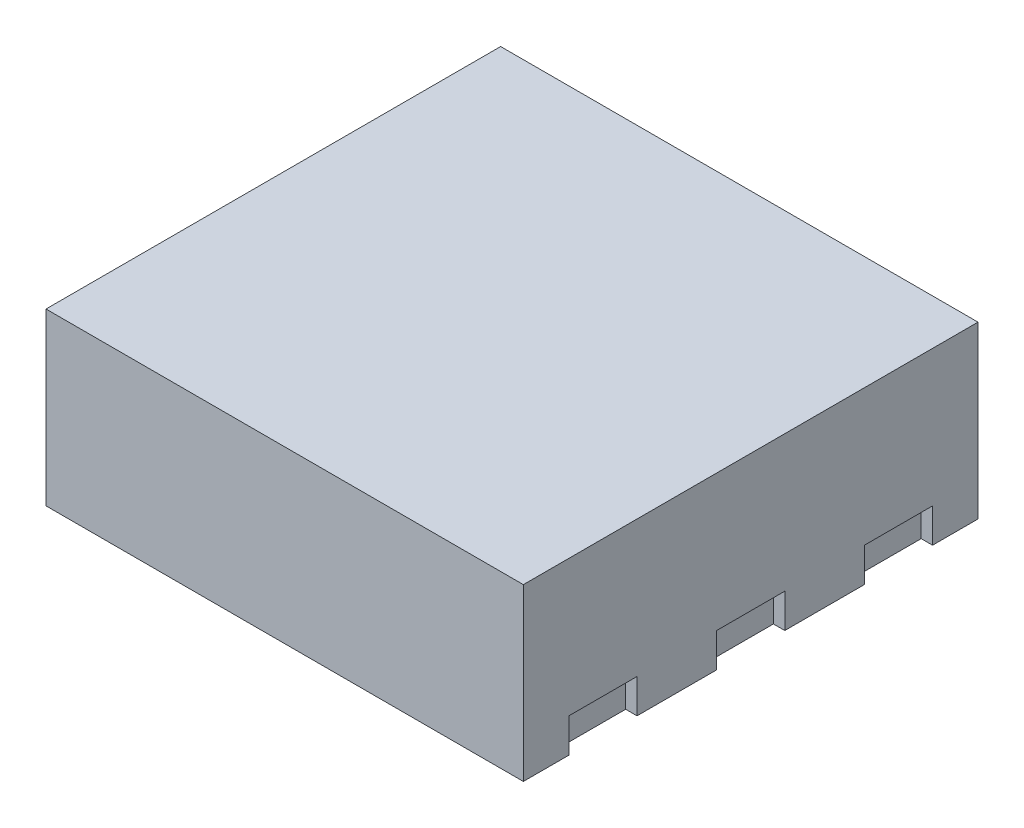
ISO-10303-21;
HEADER;
FILE_DESCRIPTION(('STEP AP214'),'2;1');
FILE_NAME('part.step','',(''),(''),'','','');
FILE_SCHEMA(('AUTOMOTIVE_DESIGN { 1 0 10303 214 1 1 1 1 }'));
ENDSEC;
DATA;
#1=APPLICATION_CONTEXT('core data for automotive mechanical design processes');
#2=APPLICATION_PROTOCOL_DEFINITION('international standard','automotive_design',2000,#1);
#3=PRODUCT_CONTEXT('',#1,'mechanical');
#4=PRODUCT('Part','Part','',(#3));
#5=PRODUCT_RELATED_PRODUCT_CATEGORY('part','',(#4));
#6=PRODUCT_DEFINITION_FORMATION('','',#4);
#7=PRODUCT_DEFINITION_CONTEXT('part definition',#1,'design');
#8=PRODUCT_DEFINITION('design','',#6,#7);
#9=PRODUCT_DEFINITION_SHAPE('','',#8);
#10=(LENGTH_UNIT() NAMED_UNIT(*) SI_UNIT(.MILLI.,.METRE.));
#11=(NAMED_UNIT(*) PLANE_ANGLE_UNIT() SI_UNIT($,.RADIAN.));
#12=(NAMED_UNIT(*) SI_UNIT($,.STERADIAN.) SOLID_ANGLE_UNIT());
#13=UNCERTAINTY_MEASURE_WITH_UNIT(LENGTH_MEASURE(1.E-05),#10,'distance_accuracy_value','');
#14=(GEOMETRIC_REPRESENTATION_CONTEXT(3) GLOBAL_UNCERTAINTY_ASSIGNED_CONTEXT((#13)) GLOBAL_UNIT_ASSIGNED_CONTEXT((#10,
#11,#12)) REPRESENTATION_CONTEXT('',''));
#15=CARTESIAN_POINT('',(0.,0.,0.));
#16=DIRECTION('',(0.,0.,1.));
#17=DIRECTION('',(1.,0.,0.));
#18=AXIS2_PLACEMENT_3D('',#15,#16,#17);
#19=CARTESIAN_POINT('',(-1.05,0.75,1.));
#20=DIRECTION('',(1.,0.,0.));
#21=DIRECTION('',(0.,0.,-1.));
#22=AXIS2_PLACEMENT_3D('',#19,#20,#21);
#23=PLANE('',#22);
#24=DIRECTION('',(0.,-1.,0.));
#25=VECTOR('',#24,1.);
#26=CARTESIAN_POINT('',(-1.05,-0.05,-0.5));
#27=LINE('',#26,#25);
#28=CARTESIAN_POINT('',(-1.05,0.15,-0.5));
#29=VERTEX_POINT('',#28);
#30=CARTESIAN_POINT('',(-1.05,0.,-0.5));
#31=VERTEX_POINT('',#30);
#32=EDGE_CURVE('E276',#29,#31,#27,.T.);
#33=ORIENTED_EDGE('',*,*,#32,.T.);
#34=DIRECTION('',(0.,0.,1.));
#35=VECTOR('',#34,1.);
#36=CARTESIAN_POINT('',(-1.05,0.,1.));
#37=LINE('',#36,#35);
#38=CARTESIAN_POINT('',(-1.05,0.,-0.15));
#39=VERTEX_POINT('',#38);
#40=EDGE_CURVE('E411',#31,#39,#37,.T.);
#41=ORIENTED_EDGE('',*,*,#40,.T.);
#42=DIRECTION('',(0.,1.,0.));
#43=VECTOR('',#42,1.);
#44=CARTESIAN_POINT('',(-1.05,-0.05,-0.15));
#45=LINE('',#44,#43);
#46=CARTESIAN_POINT('',(-1.05,0.15,-0.15));
#47=VERTEX_POINT('',#46);
#48=EDGE_CURVE('E303',#39,#47,#45,.T.);
#49=ORIENTED_EDGE('',*,*,#48,.T.);
#50=DIRECTION('',(0.,0.,1.));
#51=VECTOR('',#50,1.);
#52=CARTESIAN_POINT('',(-1.05,0.15,0.15));
#53=LINE('',#52,#51);
#54=CARTESIAN_POINT('',(-1.05,0.15,0.15));
#55=VERTEX_POINT('',#54);
#56=EDGE_CURVE('E310',#47,#55,#53,.T.);
#57=ORIENTED_EDGE('',*,*,#56,.T.);
#58=DIRECTION('',(0.,-1.,0.));
#59=VECTOR('',#58,1.);
#60=CARTESIAN_POINT('',(-1.05,-0.05,0.15));
#61=LINE('',#60,#59);
#62=CARTESIAN_POINT('',(-1.05,0.,0.15));
#63=VERTEX_POINT('',#62);
#64=EDGE_CURVE('E297',#55,#63,#61,.T.);
#65=ORIENTED_EDGE('',*,*,#64,.T.);
#66=CARTESIAN_POINT('',(-1.05,0.,0.5));
#67=VERTEX_POINT('',#66);
#68=EDGE_CURVE('E855',#63,#67,#37,.T.);
#69=ORIENTED_EDGE('',*,*,#68,.T.);
#70=DIRECTION('',(0.,1.,0.));
#71=VECTOR('',#70,1.);
#72=CARTESIAN_POINT('',(-1.05,-0.05,0.5));
#73=LINE('',#72,#71);
#74=CARTESIAN_POINT('',(-1.05,0.15,0.5));
#75=VERTEX_POINT('',#74);
#76=EDGE_CURVE('E323',#67,#75,#73,.T.);
#77=ORIENTED_EDGE('',*,*,#76,.T.);
#78=DIRECTION('',(0.,0.,1.));
#79=VECTOR('',#78,1.);
#80=CARTESIAN_POINT('',(-1.05,0.15,0.8));
#81=LINE('',#80,#79);
#82=CARTESIAN_POINT('',(-1.05,0.15,0.8));
#83=VERTEX_POINT('',#82);
#84=EDGE_CURVE('E330',#75,#83,#81,.T.);
#85=ORIENTED_EDGE('',*,*,#84,.T.);
#86=DIRECTION('',(0.,-1.,0.));
#87=VECTOR('',#86,1.);
#88=CARTESIAN_POINT('',(-1.05,-0.05,0.8));
#89=LINE('',#88,#87);
#90=CARTESIAN_POINT('',(-1.05,0.,0.8));
#91=VERTEX_POINT('',#90);
#92=EDGE_CURVE('E317',#83,#91,#89,.T.);
#93=ORIENTED_EDGE('',*,*,#92,.T.);
#94=CARTESIAN_POINT('',(-1.05,0.,1.));
#95=VERTEX_POINT('',#94);
#96=EDGE_CURVE('E393',#91,#95,#37,.T.);
#97=ORIENTED_EDGE('',*,*,#96,.T.);
#98=DIRECTION('',(0.,-1.,0.));
#99=VECTOR('',#98,1.);
#100=CARTESIAN_POINT('',(-1.05,0.75,1.));
#101=LINE('',#100,#99);
#102=CARTESIAN_POINT('',(-1.05,0.75,1.));
#103=VERTEX_POINT('',#102);
#104=EDGE_CURVE('E427',#103,#95,#101,.T.);
#105=ORIENTED_EDGE('',*,*,#104,.F.);
#106=DIRECTION('',(0.,0.,1.));
#107=VECTOR('',#106,1.);
#108=CARTESIAN_POINT('',(-1.05,0.75,1.));
#109=LINE('',#108,#107);
#110=CARTESIAN_POINT('',(-1.05,0.75,-1.));
#111=VERTEX_POINT('',#110);
#112=EDGE_CURVE('E396',#111,#103,#109,.T.);
#113=ORIENTED_EDGE('',*,*,#112,.F.);
#114=DIRECTION('',(0.,-1.,0.));
#115=VECTOR('',#114,1.);
#116=CARTESIAN_POINT('',(-1.05,0.75,-1.));
#117=LINE('',#116,#115);
#118=CARTESIAN_POINT('',(-1.05,0.,-1.));
#119=VERTEX_POINT('',#118);
#120=EDGE_CURVE('E406',#111,#119,#117,.T.);
#121=ORIENTED_EDGE('',*,*,#120,.T.);
#122=CARTESIAN_POINT('',(-1.05,0.,-0.8));
#123=VERTEX_POINT('',#122);
#124=EDGE_CURVE('E407',#119,#123,#37,.T.);
#125=ORIENTED_EDGE('',*,*,#124,.T.);
#126=DIRECTION('',(0.,1.,0.));
#127=VECTOR('',#126,1.);
#128=CARTESIAN_POINT('',(-1.05,-0.05,-0.8));
#129=LINE('',#128,#127);
#130=CARTESIAN_POINT('',(-1.05,0.15,-0.8));
#131=VERTEX_POINT('',#130);
#132=EDGE_CURVE('E284',#123,#131,#129,.T.);
#133=ORIENTED_EDGE('',*,*,#132,.T.);
#134=DIRECTION('',(0.,0.,1.));
#135=VECTOR('',#134,1.);
#136=CARTESIAN_POINT('',(-1.05,0.15,-0.5));
#137=LINE('',#136,#135);
#138=EDGE_CURVE('E290',#131,#29,#137,.T.);
#139=ORIENTED_EDGE('',*,*,#138,.T.);
#140=EDGE_LOOP('',(#33,#41,#49,#57,#65,#69,#77,#85,#93,#97,#105,#113,#121,#125,#133,#139));
#141=FACE_BOUND('',#140,.T.);
#142=ADVANCED_FACE('F33',(#141),#23,.F.);
#143=CARTESIAN_POINT('',(-1.05,0.,-1.));
#144=DIRECTION('',(0.,-1.,0.));
#145=DIRECTION('',(0.,0.,-1.));
#146=AXIS2_PLACEMENT_3D('',#143,#144,#145);
#147=PLANE('',#146);
#148=DIRECTION('',(0.,0.,-1.));
#149=VECTOR('',#148,1.);
#150=CARTESIAN_POINT('',(-0.325,0.,-0.675));
#151=LINE('',#150,#149);
#152=CARTESIAN_POINT('',(-0.325,0.,0.675));
#153=VERTEX_POINT('',#152);
#154=CARTESIAN_POINT('',(-0.325,0.,-0.675));
#155=VERTEX_POINT('',#154);
#156=EDGE_CURVE('E47',#153,#155,#151,.T.);
#157=ORIENTED_EDGE('',*,*,#156,.F.);
#158=DIRECTION('',(-1.,0.,0.));
#159=VECTOR('',#158,1.);
#160=CARTESIAN_POINT('',(-0.325,0.,0.675));
#161=LINE('',#160,#159);
#162=CARTESIAN_POINT('',(0.325,0.,0.675));
#163=VERTEX_POINT('',#162);
#164=EDGE_CURVE('E261',#163,#153,#161,.T.);
#165=ORIENTED_EDGE('',*,*,#164,.F.);
#166=DIRECTION('',(0.,0.,1.));
#167=VECTOR('',#166,1.);
#168=CARTESIAN_POINT('',(0.325,0.,-0.675));
#169=LINE('',#168,#167);
#170=CARTESIAN_POINT('',(0.325,0.,-0.675));
#171=VERTEX_POINT('',#170);
#172=EDGE_CURVE('E264',#171,#163,#169,.T.);
#173=ORIENTED_EDGE('',*,*,#172,.F.);
#174=DIRECTION('',(1.,0.,0.));
#175=VECTOR('',#174,1.);
#176=CARTESIAN_POINT('',(-0.325,0.,-0.675));
#177=LINE('',#176,#175);
#178=EDGE_CURVE('E270',#155,#171,#177,.T.);
#179=ORIENTED_EDGE('',*,*,#178,.F.);
#180=EDGE_LOOP('',(#157,#165,#173,#179));
#181=FACE_BOUND('',#180,.T.);
#182=ORIENTED_EDGE('',*,*,#40,.F.);
#183=DIRECTION('',(1.,0.,0.));
#184=VECTOR('',#183,1.);
#185=CARTESIAN_POINT('',(-1.05,0.,-0.5));
#186=LINE('',#185,#184);
#187=CARTESIAN_POINT('',(-1.,0.,-0.5));
#188=VERTEX_POINT('',#187);
#189=EDGE_CURVE('E11',#31,#188,#186,.T.);
#190=ORIENTED_EDGE('',*,*,#189,.T.);
#191=DIRECTION('',(0.,0.,1.));
#192=VECTOR('',#191,1.);
#193=CARTESIAN_POINT('',(-1.,0.,-1.));
#194=LINE('',#193,#192);
#195=CARTESIAN_POINT('',(-1.,0.,-0.8));
#196=VERTEX_POINT('',#195);
#197=EDGE_CURVE('E467',#196,#188,#194,.T.);
#198=ORIENTED_EDGE('',*,*,#197,.F.);
#199=DIRECTION('',(-1.,0.,0.));
#200=VECTOR('',#199,1.);
#201=CARTESIAN_POINT('',(-1.05,0.,-0.8));
#202=LINE('',#201,#200);
#203=EDGE_CURVE('E40',#196,#123,#202,.T.);
#204=ORIENTED_EDGE('',*,*,#203,.T.);
#205=ORIENTED_EDGE('',*,*,#124,.F.);
#206=DIRECTION('',(-1.,0.,0.));
#207=VECTOR('',#206,1.);
#208=CARTESIAN_POINT('',(-1.05,0.,-1.));
#209=LINE('',#208,#207);
#210=CARTESIAN_POINT('',(1.05,0.,-1.));
#211=VERTEX_POINT('',#210);
#212=EDGE_CURVE('E400',#211,#119,#209,.T.);
#213=ORIENTED_EDGE('',*,*,#212,.F.);
#214=DIRECTION('',(0.,0.,-1.));
#215=VECTOR('',#214,1.);
#216=CARTESIAN_POINT('',(1.05,0.,1.));
#217=LINE('',#216,#215);
#218=CARTESIAN_POINT('',(1.05,0.,-0.8));
#219=VERTEX_POINT('',#218);
#220=EDGE_CURVE('E413',#219,#211,#217,.T.);
#221=ORIENTED_EDGE('',*,*,#220,.F.);
#222=DIRECTION('',(1.,0.,0.));
#223=VECTOR('',#222,1.);
#224=CARTESIAN_POINT('',(-1.05,0.,-0.8));
#225=LINE('',#224,#223);
#226=CARTESIAN_POINT('',(1.,0.,-0.8));
#227=VERTEX_POINT('',#226);
#228=EDGE_CURVE('E446',#227,#219,#225,.T.);
#229=ORIENTED_EDGE('',*,*,#228,.F.);
#230=DIRECTION('',(0.,0.,-1.));
#231=VECTOR('',#230,1.);
#232=CARTESIAN_POINT('',(1.,0.,-1.));
#233=LINE('',#232,#231);
#234=CARTESIAN_POINT('',(1.,0.,-0.5));
#235=VERTEX_POINT('',#234);
#236=EDGE_CURVE('E444',#235,#227,#233,.T.);
#237=ORIENTED_EDGE('',*,*,#236,.F.);
#238=DIRECTION('',(-1.,0.,0.));
#239=VECTOR('',#238,1.);
#240=CARTESIAN_POINT('',(-1.05,0.,-0.5));
#241=LINE('',#240,#239);
#242=CARTESIAN_POINT('',(1.05,0.,-0.5));
#243=VERTEX_POINT('',#242);
#244=EDGE_CURVE('E448',#243,#235,#241,.T.);
#245=ORIENTED_EDGE('',*,*,#244,.F.);
#246=CARTESIAN_POINT('',(1.05,0.,-0.15));
#247=VERTEX_POINT('',#246);
#248=EDGE_CURVE('E489',#247,#243,#217,.T.);
#249=ORIENTED_EDGE('',*,*,#248,.F.);
#250=DIRECTION('',(1.,0.,0.));
#251=VECTOR('',#250,1.);
#252=CARTESIAN_POINT('',(-1.05,0.,-0.15));
#253=LINE('',#252,#251);
#254=CARTESIAN_POINT('',(1.,0.,-0.15));
#255=VERTEX_POINT('',#254);
#256=EDGE_CURVE('E439',#255,#247,#253,.T.);
#257=ORIENTED_EDGE('',*,*,#256,.F.);
#258=DIRECTION('',(0.,0.,-1.));
#259=VECTOR('',#258,1.);
#260=CARTESIAN_POINT('',(1.,0.,-1.));
#261=LINE('',#260,#259);
#262=CARTESIAN_POINT('',(1.,0.,0.15));
#263=VERTEX_POINT('',#262);
#264=EDGE_CURVE('E437',#263,#255,#261,.T.);
#265=ORIENTED_EDGE('',*,*,#264,.F.);
#266=DIRECTION('',(-1.,0.,0.));
#267=VECTOR('',#266,1.);
#268=CARTESIAN_POINT('',(-1.05,0.,0.15));
#269=LINE('',#268,#267);
#270=CARTESIAN_POINT('',(1.05,0.,0.15));
#271=VERTEX_POINT('',#270);
#272=EDGE_CURVE('E441',#271,#263,#269,.T.);
#273=ORIENTED_EDGE('',*,*,#272,.F.);
#274=CARTESIAN_POINT('',(1.05,0.,0.5));
#275=VERTEX_POINT('',#274);
#276=EDGE_CURVE('E417',#275,#271,#217,.T.);
#277=ORIENTED_EDGE('',*,*,#276,.F.);
#278=DIRECTION('',(1.,0.,0.));
#279=VECTOR('',#278,1.);
#280=CARTESIAN_POINT('',(-1.05,0.,0.5));
#281=LINE('',#280,#279);
#282=CARTESIAN_POINT('',(1.,0.,0.5));
#283=VERTEX_POINT('',#282);
#284=EDGE_CURVE('E432',#283,#275,#281,.T.);
#285=ORIENTED_EDGE('',*,*,#284,.F.);
#286=DIRECTION('',(0.,0.,-1.));
#287=VECTOR('',#286,1.);
#288=CARTESIAN_POINT('',(1.,0.,-1.));
#289=LINE('',#288,#287);
#290=CARTESIAN_POINT('',(1.,0.,0.8));
#291=VERTEX_POINT('',#290);
#292=EDGE_CURVE('E430',#291,#283,#289,.T.);
#293=ORIENTED_EDGE('',*,*,#292,.F.);
#294=DIRECTION('',(-1.,0.,0.));
#295=VECTOR('',#294,1.);
#296=CARTESIAN_POINT('',(-1.05,0.,0.8));
#297=LINE('',#296,#295);
#298=CARTESIAN_POINT('',(1.05,0.,0.8));
#299=VERTEX_POINT('',#298);
#300=EDGE_CURVE('E434',#299,#291,#297,.T.);
#301=ORIENTED_EDGE('',*,*,#300,.F.);
#302=CARTESIAN_POINT('',(1.05,0.,1.));
#303=VERTEX_POINT('',#302);
#304=EDGE_CURVE('E414',#303,#299,#217,.T.);
#305=ORIENTED_EDGE('',*,*,#304,.F.);
#306=DIRECTION('',(1.,0.,0.));
#307=VECTOR('',#306,1.);
#308=CARTESIAN_POINT('',(-1.05,0.,1.));
#309=LINE('',#308,#307);
#310=EDGE_CURVE('E410',#95,#303,#309,.T.);
#311=ORIENTED_EDGE('',*,*,#310,.F.);
#312=ORIENTED_EDGE('',*,*,#96,.F.);
#313=DIRECTION('',(1.,0.,0.));
#314=VECTOR('',#313,1.);
#315=CARTESIAN_POINT('',(-1.05,0.,0.8));
#316=LINE('',#315,#314);
#317=CARTESIAN_POINT('',(-1.,0.,0.8));
#318=VERTEX_POINT('',#317);
#319=EDGE_CURVE('E456',#91,#318,#316,.T.);
#320=ORIENTED_EDGE('',*,*,#319,.T.);
#321=DIRECTION('',(0.,0.,1.));
#322=VECTOR('',#321,1.);
#323=CARTESIAN_POINT('',(-1.,0.,-1.));
#324=LINE('',#323,#322);
#325=CARTESIAN_POINT('',(-1.,0.,0.5));
#326=VERTEX_POINT('',#325);
#327=EDGE_CURVE('E451',#326,#318,#324,.T.);
#328=ORIENTED_EDGE('',*,*,#327,.F.);
#329=DIRECTION('',(-1.,0.,0.));
#330=VECTOR('',#329,1.);
#331=CARTESIAN_POINT('',(-1.05,0.,0.5));
#332=LINE('',#331,#330);
#333=EDGE_CURVE('E453',#326,#67,#332,.T.);
#334=ORIENTED_EDGE('',*,*,#333,.T.);
#335=ORIENTED_EDGE('',*,*,#68,.F.);
#336=DIRECTION('',(1.,0.,0.));
#337=VECTOR('',#336,1.);
#338=CARTESIAN_POINT('',(-1.05,0.,0.15));
#339=LINE('',#338,#337);
#340=CARTESIAN_POINT('',(-1.,0.,0.15));
#341=VERTEX_POINT('',#340);
#342=EDGE_CURVE('E464',#63,#341,#339,.T.);
#343=ORIENTED_EDGE('',*,*,#342,.T.);
#344=DIRECTION('',(0.,0.,1.));
#345=VECTOR('',#344,1.);
#346=CARTESIAN_POINT('',(-1.,0.,-1.));
#347=LINE('',#346,#345);
#348=CARTESIAN_POINT('',(-1.,0.,-0.15));
#349=VERTEX_POINT('',#348);
#350=EDGE_CURVE('E459',#349,#341,#347,.T.);
#351=ORIENTED_EDGE('',*,*,#350,.F.);
#352=DIRECTION('',(-1.,0.,0.));
#353=VECTOR('',#352,1.);
#354=CARTESIAN_POINT('',(-1.05,0.,-0.15));
#355=LINE('',#354,#353);
#356=EDGE_CURVE('E461',#349,#39,#355,.T.);
#357=ORIENTED_EDGE('',*,*,#356,.T.);
#358=EDGE_LOOP('',(#182,#190,#198,#204,#205,#213,#221,#229,#237,#245,#249,#257,#265,#273,#277,
#285,#293,#301,#305,#311,#312,#320,#328,#334,#335,#343,#351,#357));
#359=FACE_BOUND('',#358,.T.);
#360=ADVANCED_FACE('F473',(#181,#359),#147,.T.);
#361=CARTESIAN_POINT('',(-1.05,0.75,1.));
#362=DIRECTION('',(0.,0.,-1.));
#363=DIRECTION('',(-1.,0.,0.));
#364=AXIS2_PLACEMENT_3D('',#361,#362,#363);
#365=PLANE('',#364);
#366=ORIENTED_EDGE('',*,*,#310,.T.);
#367=DIRECTION('',(0.,-1.,0.));
#368=VECTOR('',#367,1.);
#369=CARTESIAN_POINT('',(1.05,0.75,1.));
#370=LINE('',#369,#368);
#371=CARTESIAN_POINT('',(1.05,0.75,1.));
#372=VERTEX_POINT('',#371);
#373=EDGE_CURVE('E424',#372,#303,#370,.T.);
#374=ORIENTED_EDGE('',*,*,#373,.F.);
#375=DIRECTION('',(1.,0.,0.));
#376=VECTOR('',#375,1.);
#377=CARTESIAN_POINT('',(-1.05,0.75,1.));
#378=LINE('',#377,#376);
#379=EDGE_CURVE('E399',#103,#372,#378,.T.);
#380=ORIENTED_EDGE('',*,*,#379,.F.);
#381=ORIENTED_EDGE('',*,*,#104,.T.);
#382=EDGE_LOOP('',(#366,#374,#380,#381));
#383=FACE_BOUND('',#382,.T.);
#384=ADVANCED_FACE('F545',(#383),#365,.F.);
#385=CARTESIAN_POINT('',(1.05,0.75,1.));
#386=DIRECTION('',(-1.,0.,0.));
#387=DIRECTION('',(0.,0.,1.));
#388=AXIS2_PLACEMENT_3D('',#385,#386,#387);
#389=PLANE('',#388);
#390=ORIENTED_EDGE('',*,*,#248,.T.);
#391=DIRECTION('',(0.,-1.,0.));
#392=VECTOR('',#391,1.);
#393=CARTESIAN_POINT('',(1.05,-0.05,-0.5));
#394=LINE('',#393,#392);
#395=CARTESIAN_POINT('',(1.05,0.15,-0.5));
#396=VERTEX_POINT('',#395);
#397=EDGE_CURVE('E337',#396,#243,#394,.T.);
#398=ORIENTED_EDGE('',*,*,#397,.F.);
#399=DIRECTION('',(0.,0.,1.));
#400=VECTOR('',#399,1.);
#401=CARTESIAN_POINT('',(1.05,0.15,-0.5));
#402=LINE('',#401,#400);
#403=CARTESIAN_POINT('',(1.05,0.15,-0.8));
#404=VERTEX_POINT('',#403);
#405=EDGE_CURVE('E342',#404,#396,#402,.T.);
#406=ORIENTED_EDGE('',*,*,#405,.F.);
#407=DIRECTION('',(0.,1.,0.));
#408=VECTOR('',#407,1.);
#409=CARTESIAN_POINT('',(1.05,-0.05,-0.8));
#410=LINE('',#409,#408);
#411=EDGE_CURVE('E349',#219,#404,#410,.T.);
#412=ORIENTED_EDGE('',*,*,#411,.F.);
#413=ORIENTED_EDGE('',*,*,#220,.T.);
#414=DIRECTION('',(0.,-1.,0.));
#415=VECTOR('',#414,1.);
#416=CARTESIAN_POINT('',(1.05,0.75,-1.));
#417=LINE('',#416,#415);
#418=CARTESIAN_POINT('',(1.05,0.75,-1.));
#419=VERTEX_POINT('',#418);
#420=EDGE_CURVE('E421',#419,#211,#417,.T.);
#421=ORIENTED_EDGE('',*,*,#420,.F.);
#422=DIRECTION('',(0.,0.,-1.));
#423=VECTOR('',#422,1.);
#424=CARTESIAN_POINT('',(1.05,0.75,1.));
#425=LINE('',#424,#423);
#426=EDGE_CURVE('E402',#372,#419,#425,.T.);
#427=ORIENTED_EDGE('',*,*,#426,.F.);
#428=ORIENTED_EDGE('',*,*,#373,.T.);
#429=ORIENTED_EDGE('',*,*,#304,.T.);
#430=DIRECTION('',(0.,-1.,0.));
#431=VECTOR('',#430,1.);
#432=CARTESIAN_POINT('',(1.05,-0.05,0.8));
#433=LINE('',#432,#431);
#434=CARTESIAN_POINT('',(1.05,0.15,0.8));
#435=VERTEX_POINT('',#434);
#436=EDGE_CURVE('E374',#435,#299,#433,.T.);
#437=ORIENTED_EDGE('',*,*,#436,.F.);
#438=DIRECTION('',(0.,0.,1.));
#439=VECTOR('',#438,1.);
#440=CARTESIAN_POINT('',(1.05,0.15,0.8));
#441=LINE('',#440,#439);
#442=CARTESIAN_POINT('',(1.05,0.15,0.5));
#443=VERTEX_POINT('',#442);
#444=EDGE_CURVE('E380',#443,#435,#441,.T.);
#445=ORIENTED_EDGE('',*,*,#444,.F.);
#446=DIRECTION('',(0.,1.,0.));
#447=VECTOR('',#446,1.);
#448=CARTESIAN_POINT('',(1.05,-0.05,0.5));
#449=LINE('',#448,#447);
#450=EDGE_CURVE('E387',#275,#443,#449,.T.);
#451=ORIENTED_EDGE('',*,*,#450,.F.);
#452=ORIENTED_EDGE('',*,*,#276,.T.);
#453=DIRECTION('',(0.,-1.,0.));
#454=VECTOR('',#453,1.);
#455=CARTESIAN_POINT('',(1.05,-0.05,0.15));
#456=LINE('',#455,#454);
#457=CARTESIAN_POINT('',(1.05,0.15,0.15));
#458=VERTEX_POINT('',#457);
#459=EDGE_CURVE('E355',#458,#271,#456,.T.);
#460=ORIENTED_EDGE('',*,*,#459,.F.);
#461=DIRECTION('',(0.,0.,1.));
#462=VECTOR('',#461,1.);
#463=CARTESIAN_POINT('',(1.05,0.15,0.15));
#464=LINE('',#463,#462);
#465=CARTESIAN_POINT('',(1.05,0.15,-0.15));
#466=VERTEX_POINT('',#465);
#467=EDGE_CURVE('E361',#466,#458,#464,.T.);
#468=ORIENTED_EDGE('',*,*,#467,.F.);
#469=DIRECTION('',(0.,1.,0.));
#470=VECTOR('',#469,1.);
#471=CARTESIAN_POINT('',(1.05,-0.05,-0.15));
#472=LINE('',#471,#470);
#473=EDGE_CURVE('E368',#247,#466,#472,.T.);
#474=ORIENTED_EDGE('',*,*,#473,.F.);
#475=EDGE_LOOP('',(#390,#398,#406,#412,#413,#421,#427,#428,#429,#437,#445,#451,#452,#460,#468,#474));
#476=FACE_BOUND('',#475,.T.);
#477=ADVANCED_FACE('F498',(#476),#389,.F.);
#478=CARTESIAN_POINT('',(-1.05,0.75,-1.));
#479=DIRECTION('',(0.,0.,1.));
#480=DIRECTION('',(1.,0.,0.));
#481=AXIS2_PLACEMENT_3D('',#478,#479,#480);
#482=PLANE('',#481);
#483=ORIENTED_EDGE('',*,*,#212,.T.);
#484=ORIENTED_EDGE('',*,*,#120,.F.);
#485=DIRECTION('',(-1.,0.,0.));
#486=VECTOR('',#485,1.);
#487=CARTESIAN_POINT('',(-1.05,0.75,-1.));
#488=LINE('',#487,#486);
#489=EDGE_CURVE('E404',#419,#111,#488,.T.);
#490=ORIENTED_EDGE('',*,*,#489,.F.);
#491=ORIENTED_EDGE('',*,*,#420,.T.);
#492=EDGE_LOOP('',(#483,#484,#490,#491));
#493=FACE_BOUND('',#492,.T.);
#494=ADVANCED_FACE('F482',(#493),#482,.F.);
#495=CARTESIAN_POINT('',(-1.05,0.75,-1.));
#496=DIRECTION('',(0.,-1.,0.));
#497=DIRECTION('',(0.,0.,-1.));
#498=AXIS2_PLACEMENT_3D('',#495,#496,#497);
#499=PLANE('',#498);
#500=ORIENTED_EDGE('',*,*,#112,.T.);
#501=ORIENTED_EDGE('',*,*,#379,.T.);
#502=ORIENTED_EDGE('',*,*,#426,.T.);
#503=ORIENTED_EDGE('',*,*,#489,.T.);
#504=EDGE_LOOP('',(#500,#501,#502,#503));
#505=FACE_BOUND('',#504,.T.);
#506=ADVANCED_FACE('F555',(#505),#499,.F.);
#507=CARTESIAN_POINT('',(1.,-0.05,0.8));
#508=DIRECTION('',(0.,0.,1.));
#509=DIRECTION('',(1.,0.,0.));
#510=AXIS2_PLACEMENT_3D('',#507,#508,#509);
#511=PLANE('',#510);
#512=ORIENTED_EDGE('',*,*,#300,.T.);
#513=DIRECTION('',(0.,-1.,0.));
#514=VECTOR('',#513,1.);
#515=CARTESIAN_POINT('',(1.,-0.05,0.8));
#516=LINE('',#515,#514);
#517=CARTESIAN_POINT('',(1.,0.15,0.8));
#518=VERTEX_POINT('',#517);
#519=EDGE_CURVE('E377',#518,#291,#516,.T.);
#520=ORIENTED_EDGE('',*,*,#519,.F.);
#521=DIRECTION('',(1.,0.,0.));
#522=VECTOR('',#521,1.);
#523=CARTESIAN_POINT('',(1.,0.15,0.8));
#524=LINE('',#523,#522);
#525=EDGE_CURVE('E391',#518,#435,#524,.T.);
#526=ORIENTED_EDGE('',*,*,#525,.T.);
#527=ORIENTED_EDGE('',*,*,#436,.T.);
#528=EDGE_LOOP('',(#512,#520,#526,#527));
#529=FACE_BOUND('',#528,.T.);
#530=ADVANCED_FACE('F575',(#529),#511,.F.);
#531=CARTESIAN_POINT('',(1.,0.15,0.8));
#532=DIRECTION('',(0.,1.,0.));
#533=DIRECTION('',(0.,0.,1.));
#534=AXIS2_PLACEMENT_3D('',#531,#532,#533);
#535=PLANE('',#534);
#536=ORIENTED_EDGE('',*,*,#444,.T.);
#537=ORIENTED_EDGE('',*,*,#525,.F.);
#538=DIRECTION('',(0.,0.,1.));
#539=VECTOR('',#538,1.);
#540=CARTESIAN_POINT('',(1.,0.15,0.8));
#541=LINE('',#540,#539);
#542=CARTESIAN_POINT('',(1.,0.15,0.5));
#543=VERTEX_POINT('',#542);
#544=EDGE_CURVE('E382',#543,#518,#541,.T.);
#545=ORIENTED_EDGE('',*,*,#544,.F.);
#546=DIRECTION('',(1.,0.,0.));
#547=VECTOR('',#546,1.);
#548=CARTESIAN_POINT('',(1.,0.15,0.5));
#549=LINE('',#548,#547);
#550=EDGE_CURVE('E385',#543,#443,#549,.T.);
#551=ORIENTED_EDGE('',*,*,#550,.T.);
#552=EDGE_LOOP('',(#536,#537,#545,#551));
#553=FACE_BOUND('',#552,.T.);
#554=ADVANCED_FACE('F582',(#553),#535,.F.);
#555=CARTESIAN_POINT('',(1.,-0.05,0.5));
#556=DIRECTION('',(0.,0.,-1.));
#557=DIRECTION('',(-1.,0.,0.));
#558=AXIS2_PLACEMENT_3D('',#555,#556,#557);
#559=PLANE('',#558);
#560=ORIENTED_EDGE('',*,*,#284,.T.);
#561=ORIENTED_EDGE('',*,*,#450,.T.);
#562=ORIENTED_EDGE('',*,*,#550,.F.);
#563=DIRECTION('',(0.,1.,0.));
#564=VECTOR('',#563,1.);
#565=CARTESIAN_POINT('',(1.,-0.05,0.5));
#566=LINE('',#565,#564);
#567=EDGE_CURVE('E379',#283,#543,#566,.T.);
#568=ORIENTED_EDGE('',*,*,#567,.F.);
#569=EDGE_LOOP('',(#560,#561,#562,#568));
#570=FACE_BOUND('',#569,.T.);
#571=ADVANCED_FACE('F590',(#570),#559,.F.);
#572=CARTESIAN_POINT('',(1.,0.15,0.8));
#573=DIRECTION('',(-1.,0.,0.));
#574=DIRECTION('',(0.,0.,1.));
#575=AXIS2_PLACEMENT_3D('',#572,#573,#574);
#576=PLANE('',#575);
#577=ORIENTED_EDGE('',*,*,#292,.T.);
#578=ORIENTED_EDGE('',*,*,#567,.T.);
#579=ORIENTED_EDGE('',*,*,#544,.T.);
#580=ORIENTED_EDGE('',*,*,#519,.T.);
#581=EDGE_LOOP('',(#577,#578,#579,#580));
#582=FACE_BOUND('',#581,.T.);
#583=ADVANCED_FACE('F599',(#582),#576,.F.);
#584=CARTESIAN_POINT('',(1.,-0.05,0.15));
#585=DIRECTION('',(0.,0.,1.));
#586=DIRECTION('',(1.,0.,0.));
#587=AXIS2_PLACEMENT_3D('',#584,#585,#586);
#588=PLANE('',#587);
#589=ORIENTED_EDGE('',*,*,#272,.T.);
#590=DIRECTION('',(0.,-1.,0.));
#591=VECTOR('',#590,1.);
#592=CARTESIAN_POINT('',(1.,-0.05,0.15));
#593=LINE('',#592,#591);
#594=CARTESIAN_POINT('',(1.,0.15,0.15));
#595=VERTEX_POINT('',#594);
#596=EDGE_CURVE('E358',#595,#263,#593,.T.);
#597=ORIENTED_EDGE('',*,*,#596,.F.);
#598=DIRECTION('',(1.,0.,0.));
#599=VECTOR('',#598,1.);
#600=CARTESIAN_POINT('',(1.,0.15,0.15));
#601=LINE('',#600,#599);
#602=EDGE_CURVE('E372',#595,#458,#601,.T.);
#603=ORIENTED_EDGE('',*,*,#602,.T.);
#604=ORIENTED_EDGE('',*,*,#459,.T.);
#605=EDGE_LOOP('',(#589,#597,#603,#604));
#606=FACE_BOUND('',#605,.T.);
#607=ADVANCED_FACE('F508',(#606),#588,.F.);
#608=CARTESIAN_POINT('',(1.,0.15,0.15));
#609=DIRECTION('',(0.,1.,0.));
#610=DIRECTION('',(0.,0.,1.));
#611=AXIS2_PLACEMENT_3D('',#608,#609,#610);
#612=PLANE('',#611);
#613=ORIENTED_EDGE('',*,*,#467,.T.);
#614=ORIENTED_EDGE('',*,*,#602,.F.);
#615=DIRECTION('',(0.,0.,1.));
#616=VECTOR('',#615,1.);
#617=CARTESIAN_POINT('',(1.,0.15,0.15));
#618=LINE('',#617,#616);
#619=CARTESIAN_POINT('',(1.,0.15,-0.15));
#620=VERTEX_POINT('',#619);
#621=EDGE_CURVE('E363',#620,#595,#618,.T.);
#622=ORIENTED_EDGE('',*,*,#621,.F.);
#623=DIRECTION('',(1.,0.,0.));
#624=VECTOR('',#623,1.);
#625=CARTESIAN_POINT('',(1.,0.15,-0.15));
#626=LINE('',#625,#624);
#627=EDGE_CURVE('E366',#620,#466,#626,.T.);
#628=ORIENTED_EDGE('',*,*,#627,.T.);
#629=EDGE_LOOP('',(#613,#614,#622,#628));
#630=FACE_BOUND('',#629,.T.);
#631=ADVANCED_FACE('F511',(#630),#612,.F.);
#632=CARTESIAN_POINT('',(1.,-0.05,-0.15));
#633=DIRECTION('',(0.,0.,-1.));
#634=DIRECTION('',(0.,1.,0.));
#635=AXIS2_PLACEMENT_3D('',#632,#633,#634);
#636=PLANE('',#635);
#637=ORIENTED_EDGE('',*,*,#256,.T.);
#638=ORIENTED_EDGE('',*,*,#473,.T.);
#639=ORIENTED_EDGE('',*,*,#627,.F.);
#640=DIRECTION('',(0.,1.,0.));
#641=VECTOR('',#640,1.);
#642=CARTESIAN_POINT('',(1.,-0.05,-0.15));
#643=LINE('',#642,#641);
#644=EDGE_CURVE('E360',#255,#620,#643,.T.);
#645=ORIENTED_EDGE('',*,*,#644,.F.);
#646=EDGE_LOOP('',(#637,#638,#639,#645));
#647=FACE_BOUND('',#646,.T.);
#648=ADVANCED_FACE('F621',(#647),#636,.F.);
#649=CARTESIAN_POINT('',(1.,0.15,0.15));
#650=DIRECTION('',(-1.,0.,0.));
#651=DIRECTION('',(0.,0.,1.));
#652=AXIS2_PLACEMENT_3D('',#649,#650,#651);
#653=PLANE('',#652);
#654=ORIENTED_EDGE('',*,*,#264,.T.);
#655=ORIENTED_EDGE('',*,*,#644,.T.);
#656=ORIENTED_EDGE('',*,*,#621,.T.);
#657=ORIENTED_EDGE('',*,*,#596,.T.);
#658=EDGE_LOOP('',(#654,#655,#656,#657));
#659=FACE_BOUND('',#658,.T.);
#660=ADVANCED_FACE('F628',(#659),#653,.F.);
#661=CARTESIAN_POINT('',(1.,-0.05,-0.5));
#662=DIRECTION('',(0.,0.,1.));
#663=DIRECTION('',(1.,0.,0.));
#664=AXIS2_PLACEMENT_3D('',#661,#662,#663);
#665=PLANE('',#664);
#666=ORIENTED_EDGE('',*,*,#244,.T.);
#667=DIRECTION('',(0.,-1.,0.));
#668=VECTOR('',#667,1.);
#669=CARTESIAN_POINT('',(1.,-0.05,-0.5));
#670=LINE('',#669,#668);
#671=CARTESIAN_POINT('',(1.,0.15,-0.5));
#672=VERTEX_POINT('',#671);
#673=EDGE_CURVE('E339',#672,#235,#670,.T.);
#674=ORIENTED_EDGE('',*,*,#673,.F.);
#675=DIRECTION('',(1.,0.,0.));
#676=VECTOR('',#675,1.);
#677=CARTESIAN_POINT('',(1.,0.15,-0.5));
#678=LINE('',#677,#676);
#679=EDGE_CURVE('E353',#672,#396,#678,.T.);
#680=ORIENTED_EDGE('',*,*,#679,.T.);
#681=ORIENTED_EDGE('',*,*,#397,.T.);
#682=EDGE_LOOP('',(#666,#674,#680,#681));
#683=FACE_BOUND('',#682,.T.);
#684=ADVANCED_FACE('F517',(#683),#665,.F.);
#685=CARTESIAN_POINT('',(1.,0.15,-0.5));
#686=DIRECTION('',(0.,1.,0.));
#687=DIRECTION('',(0.,0.,1.));
#688=AXIS2_PLACEMENT_3D('',#685,#686,#687);
#689=PLANE('',#688);
#690=ORIENTED_EDGE('',*,*,#405,.T.);
#691=ORIENTED_EDGE('',*,*,#679,.F.);
#692=DIRECTION('',(0.,0.,1.));
#693=VECTOR('',#692,1.);
#694=CARTESIAN_POINT('',(1.,0.15,-0.5));
#695=LINE('',#694,#693);
#696=CARTESIAN_POINT('',(1.,0.15,-0.8));
#697=VERTEX_POINT('',#696);
#698=EDGE_CURVE('E344',#697,#672,#695,.T.);
#699=ORIENTED_EDGE('',*,*,#698,.F.);
#700=DIRECTION('',(1.,0.,0.));
#701=VECTOR('',#700,1.);
#702=CARTESIAN_POINT('',(1.,0.15,-0.8));
#703=LINE('',#702,#701);
#704=EDGE_CURVE('E347',#697,#404,#703,.T.);
#705=ORIENTED_EDGE('',*,*,#704,.T.);
#706=EDGE_LOOP('',(#690,#691,#699,#705));
#707=FACE_BOUND('',#706,.T.);
#708=ADVANCED_FACE('F520',(#707),#689,.F.);
#709=CARTESIAN_POINT('',(1.,-0.05,-0.8));
#710=DIRECTION('',(0.,0.,-1.));
#711=DIRECTION('',(-1.,0.,0.));
#712=AXIS2_PLACEMENT_3D('',#709,#710,#711);
#713=PLANE('',#712);
#714=ORIENTED_EDGE('',*,*,#228,.T.);
#715=ORIENTED_EDGE('',*,*,#411,.T.);
#716=ORIENTED_EDGE('',*,*,#704,.F.);
#717=DIRECTION('',(0.,1.,0.));
#718=VECTOR('',#717,1.);
#719=CARTESIAN_POINT('',(1.,-0.05,-0.8));
#720=LINE('',#719,#718);
#721=EDGE_CURVE('E341',#227,#697,#720,.T.);
#722=ORIENTED_EDGE('',*,*,#721,.F.);
#723=EDGE_LOOP('',(#714,#715,#716,#722));
#724=FACE_BOUND('',#723,.T.);
#725=ADVANCED_FACE('F525',(#724),#713,.F.);
#726=CARTESIAN_POINT('',(1.,0.15,-0.5));
#727=DIRECTION('',(-1.,0.,0.));
#728=DIRECTION('',(0.,0.,1.));
#729=AXIS2_PLACEMENT_3D('',#726,#727,#728);
#730=PLANE('',#729);
#731=ORIENTED_EDGE('',*,*,#236,.T.);
#732=ORIENTED_EDGE('',*,*,#721,.T.);
#733=ORIENTED_EDGE('',*,*,#698,.T.);
#734=ORIENTED_EDGE('',*,*,#673,.T.);
#735=EDGE_LOOP('',(#731,#732,#733,#734));
#736=FACE_BOUND('',#735,.T.);
#737=ADVANCED_FACE('F527',(#736),#730,.F.);
#738=CARTESIAN_POINT('',(-1.,-0.05,0.8));
#739=DIRECTION('',(0.,0.,-1.));
#740=DIRECTION('',(-1.,0.,0.));
#741=AXIS2_PLACEMENT_3D('',#738,#739,#740);
#742=PLANE('',#741);
#743=ORIENTED_EDGE('',*,*,#92,.F.);
#744=DIRECTION('',(-1.,0.,0.));
#745=VECTOR('',#744,1.);
#746=CARTESIAN_POINT('',(-1.,0.15,0.8));
#747=LINE('',#746,#745);
#748=CARTESIAN_POINT('',(-1.,0.15,0.8));
#749=VERTEX_POINT('',#748);
#750=EDGE_CURVE('E327',#749,#83,#747,.T.);
#751=ORIENTED_EDGE('',*,*,#750,.F.);
#752=DIRECTION('',(0.,-1.,0.));
#753=VECTOR('',#752,1.);
#754=CARTESIAN_POINT('',(-1.,-0.05,0.8));
#755=LINE('',#754,#753);
#756=EDGE_CURVE('E319',#749,#318,#755,.T.);
#757=ORIENTED_EDGE('',*,*,#756,.T.);
#758=ORIENTED_EDGE('',*,*,#319,.F.);
#759=EDGE_LOOP('',(#743,#751,#757,#758));
#760=FACE_BOUND('',#759,.T.);
#761=ADVANCED_FACE('F529',(#760),#742,.T.);
#762=CARTESIAN_POINT('',(-1.,-0.05,0.5));
#763=DIRECTION('',(0.,0.,1.));
#764=DIRECTION('',(1.,0.,0.));
#765=AXIS2_PLACEMENT_3D('',#762,#763,#764);
#766=PLANE('',#765);
#767=DIRECTION('',(0.,1.,0.));
#768=VECTOR('',#767,1.);
#769=CARTESIAN_POINT('',(-1.,-0.05,0.5));
#770=LINE('',#769,#768);
#771=CARTESIAN_POINT('',(-1.,0.15,0.5));
#772=VERTEX_POINT('',#771);
#773=EDGE_CURVE('E325',#326,#772,#770,.T.);
#774=ORIENTED_EDGE('',*,*,#773,.T.);
#775=DIRECTION('',(-1.,0.,0.));
#776=VECTOR('',#775,1.);
#777=CARTESIAN_POINT('',(-1.,0.15,0.5));
#778=LINE('',#777,#776);
#779=EDGE_CURVE('E335',#772,#75,#778,.T.);
#780=ORIENTED_EDGE('',*,*,#779,.T.);
#781=ORIENTED_EDGE('',*,*,#76,.F.);
#782=ORIENTED_EDGE('',*,*,#333,.F.);
#783=EDGE_LOOP('',(#774,#780,#781,#782));
#784=FACE_BOUND('',#783,.T.);
#785=ADVANCED_FACE('F535',(#784),#766,.T.);
#786=CARTESIAN_POINT('',(-1.,0.15,0.8));
#787=DIRECTION('',(0.,-1.,0.));
#788=DIRECTION('',(0.,0.,-1.));
#789=AXIS2_PLACEMENT_3D('',#786,#787,#788);
#790=PLANE('',#789);
#791=ORIENTED_EDGE('',*,*,#84,.F.);
#792=ORIENTED_EDGE('',*,*,#779,.F.);
#793=DIRECTION('',(0.,0.,1.));
#794=VECTOR('',#793,1.);
#795=CARTESIAN_POINT('',(-1.,0.15,0.8));
#796=LINE('',#795,#794);
#797=EDGE_CURVE('E322',#772,#749,#796,.T.);
#798=ORIENTED_EDGE('',*,*,#797,.T.);
#799=ORIENTED_EDGE('',*,*,#750,.T.);
#800=EDGE_LOOP('',(#791,#792,#798,#799));
#801=FACE_BOUND('',#800,.T.);
#802=ADVANCED_FACE('F683',(#801),#790,.T.);
#803=CARTESIAN_POINT('',(-1.,0.15,0.8));
#804=DIRECTION('',(1.,0.,0.));
#805=DIRECTION('',(0.,0.,1.));
#806=AXIS2_PLACEMENT_3D('',#803,#804,#805);
#807=PLANE('',#806);
#808=ORIENTED_EDGE('',*,*,#327,.T.);
#809=ORIENTED_EDGE('',*,*,#756,.F.);
#810=ORIENTED_EDGE('',*,*,#797,.F.);
#811=ORIENTED_EDGE('',*,*,#773,.F.);
#812=EDGE_LOOP('',(#808,#809,#810,#811));
#813=FACE_BOUND('',#812,.T.);
#814=ADVANCED_FACE('F693',(#813),#807,.F.);
#815=CARTESIAN_POINT('',(-1.,-0.05,0.15));
#816=DIRECTION('',(0.,0.,-1.));
#817=DIRECTION('',(-1.,0.,0.));
#818=AXIS2_PLACEMENT_3D('',#815,#816,#817);
#819=PLANE('',#818);
#820=ORIENTED_EDGE('',*,*,#64,.F.);
#821=DIRECTION('',(-1.,0.,0.));
#822=VECTOR('',#821,1.);
#823=CARTESIAN_POINT('',(-1.,0.15,0.15));
#824=LINE('',#823,#822);
#825=CARTESIAN_POINT('',(-1.,0.15,0.15));
#826=VERTEX_POINT('',#825);
#827=EDGE_CURVE('E307',#826,#55,#824,.T.);
#828=ORIENTED_EDGE('',*,*,#827,.F.);
#829=DIRECTION('',(0.,-1.,0.));
#830=VECTOR('',#829,1.);
#831=CARTESIAN_POINT('',(-1.,-0.05,0.15));
#832=LINE('',#831,#830);
#833=EDGE_CURVE('E299',#826,#341,#832,.T.);
#834=ORIENTED_EDGE('',*,*,#833,.T.);
#835=ORIENTED_EDGE('',*,*,#342,.F.);
#836=EDGE_LOOP('',(#820,#828,#834,#835));
#837=FACE_BOUND('',#836,.T.);
#838=ADVANCED_FACE('F704',(#837),#819,.T.);
#839=CARTESIAN_POINT('',(-1.,-0.05,-0.15));
#840=DIRECTION('',(0.,0.,1.));
#841=DIRECTION('',(0.,-1.,0.));
#842=AXIS2_PLACEMENT_3D('',#839,#840,#841);
#843=PLANE('',#842);
#844=DIRECTION('',(0.,1.,0.));
#845=VECTOR('',#844,1.);
#846=CARTESIAN_POINT('',(-1.,-0.05,-0.15));
#847=LINE('',#846,#845);
#848=CARTESIAN_POINT('',(-1.,0.15,-0.15));
#849=VERTEX_POINT('',#848);
#850=EDGE_CURVE('E305',#349,#849,#847,.T.);
#851=ORIENTED_EDGE('',*,*,#850,.T.);
#852=DIRECTION('',(-1.,0.,0.));
#853=VECTOR('',#852,1.);
#854=CARTESIAN_POINT('',(-1.,0.15,-0.15));
#855=LINE('',#854,#853);
#856=EDGE_CURVE('E315',#849,#47,#855,.T.);
#857=ORIENTED_EDGE('',*,*,#856,.T.);
#858=ORIENTED_EDGE('',*,*,#48,.F.);
#859=ORIENTED_EDGE('',*,*,#356,.F.);
#860=EDGE_LOOP('',(#851,#857,#858,#859));
#861=FACE_BOUND('',#860,.T.);
#862=ADVANCED_FACE('F715',(#861),#843,.T.);
#863=CARTESIAN_POINT('',(-1.,0.15,0.15));
#864=DIRECTION('',(0.,-1.,0.));
#865=DIRECTION('',(0.,0.,-1.));
#866=AXIS2_PLACEMENT_3D('',#863,#864,#865);
#867=PLANE('',#866);
#868=ORIENTED_EDGE('',*,*,#56,.F.);
#869=ORIENTED_EDGE('',*,*,#856,.F.);
#870=DIRECTION('',(0.,0.,1.));
#871=VECTOR('',#870,1.);
#872=CARTESIAN_POINT('',(-1.,0.15,0.15));
#873=LINE('',#872,#871);
#874=EDGE_CURVE('E302',#849,#826,#873,.T.);
#875=ORIENTED_EDGE('',*,*,#874,.T.);
#876=ORIENTED_EDGE('',*,*,#827,.T.);
#877=EDGE_LOOP('',(#868,#869,#875,#876));
#878=FACE_BOUND('',#877,.T.);
#879=ADVANCED_FACE('F726',(#878),#867,.T.);
#880=CARTESIAN_POINT('',(-1.,0.15,0.15));
#881=DIRECTION('',(1.,0.,0.));
#882=DIRECTION('',(0.,0.,1.));
#883=AXIS2_PLACEMENT_3D('',#880,#881,#882);
#884=PLANE('',#883);
#885=ORIENTED_EDGE('',*,*,#350,.T.);
#886=ORIENTED_EDGE('',*,*,#833,.F.);
#887=ORIENTED_EDGE('',*,*,#874,.F.);
#888=ORIENTED_EDGE('',*,*,#850,.F.);
#889=EDGE_LOOP('',(#885,#886,#887,#888));
#890=FACE_BOUND('',#889,.T.);
#891=ADVANCED_FACE('F736',(#890),#884,.F.);
#892=CARTESIAN_POINT('',(-1.,-0.05,-0.5));
#893=DIRECTION('',(0.,0.,-1.));
#894=DIRECTION('',(-1.,0.,0.));
#895=AXIS2_PLACEMENT_3D('',#892,#893,#894);
#896=PLANE('',#895);
#897=ORIENTED_EDGE('',*,*,#32,.F.);
#898=DIRECTION('',(-1.,0.,0.));
#899=VECTOR('',#898,1.);
#900=CARTESIAN_POINT('',(-1.,0.15,-0.5));
#901=LINE('',#900,#899);
#902=CARTESIAN_POINT('',(-1.,0.15,-0.5));
#903=VERTEX_POINT('',#902);
#904=EDGE_CURVE('E287',#903,#29,#901,.T.);
#905=ORIENTED_EDGE('',*,*,#904,.F.);
#906=DIRECTION('',(0.,-1.,0.));
#907=VECTOR('',#906,1.);
#908=CARTESIAN_POINT('',(-1.,-0.05,-0.5));
#909=LINE('',#908,#907);
#910=EDGE_CURVE('E280',#903,#188,#909,.T.);
#911=ORIENTED_EDGE('',*,*,#910,.T.);
#912=ORIENTED_EDGE('',*,*,#189,.F.);
#913=EDGE_LOOP('',(#897,#905,#911,#912));
#914=FACE_BOUND('',#913,.T.);
#915=ADVANCED_FACE('F747',(#914),#896,.T.);
#916=CARTESIAN_POINT('',(-1.,-0.05,-0.8));
#917=DIRECTION('',(0.,0.,1.));
#918=DIRECTION('',(1.,0.,0.));
#919=AXIS2_PLACEMENT_3D('',#916,#917,#918);
#920=PLANE('',#919);
#921=DIRECTION('',(0.,1.,0.));
#922=VECTOR('',#921,1.);
#923=CARTESIAN_POINT('',(-1.,-0.05,-0.8));
#924=LINE('',#923,#922);
#925=CARTESIAN_POINT('',(-1.,0.15,-0.8));
#926=VERTEX_POINT('',#925);
#927=EDGE_CURVE('E55',#196,#926,#924,.T.);
#928=ORIENTED_EDGE('',*,*,#927,.T.);
#929=DIRECTION('',(-1.,0.,0.));
#930=VECTOR('',#929,1.);
#931=CARTESIAN_POINT('',(-1.,0.15,-0.8));
#932=LINE('',#931,#930);
#933=EDGE_CURVE('E295',#926,#131,#932,.T.);
#934=ORIENTED_EDGE('',*,*,#933,.T.);
#935=ORIENTED_EDGE('',*,*,#132,.F.);
#936=ORIENTED_EDGE('',*,*,#203,.F.);
#937=EDGE_LOOP('',(#928,#934,#935,#936));
#938=FACE_BOUND('',#937,.T.);
#939=ADVANCED_FACE('F758',(#938),#920,.T.);
#940=CARTESIAN_POINT('',(-1.,0.15,-0.5));
#941=DIRECTION('',(0.,-1.,0.));
#942=DIRECTION('',(0.,0.,-1.));
#943=AXIS2_PLACEMENT_3D('',#940,#941,#942);
#944=PLANE('',#943);
#945=ORIENTED_EDGE('',*,*,#138,.F.);
#946=ORIENTED_EDGE('',*,*,#933,.F.);
#947=DIRECTION('',(0.,0.,1.));
#948=VECTOR('',#947,1.);
#949=CARTESIAN_POINT('',(-1.,0.15,-0.5));
#950=LINE('',#949,#948);
#951=EDGE_CURVE('E283',#926,#903,#950,.T.);
#952=ORIENTED_EDGE('',*,*,#951,.T.);
#953=ORIENTED_EDGE('',*,*,#904,.T.);
#954=EDGE_LOOP('',(#945,#946,#952,#953));
#955=FACE_BOUND('',#954,.T.);
#956=ADVANCED_FACE('F770',(#955),#944,.T.);
#957=CARTESIAN_POINT('',(-1.,0.15,-0.5));
#958=DIRECTION('',(1.,0.,0.));
#959=DIRECTION('',(0.,0.,1.));
#960=AXIS2_PLACEMENT_3D('',#957,#958,#959);
#961=PLANE('',#960);
#962=ORIENTED_EDGE('',*,*,#197,.T.);
#963=ORIENTED_EDGE('',*,*,#910,.F.);
#964=ORIENTED_EDGE('',*,*,#951,.F.);
#965=ORIENTED_EDGE('',*,*,#927,.F.);
#966=EDGE_LOOP('',(#962,#963,#964,#965));
#967=FACE_BOUND('',#966,.T.);
#968=ADVANCED_FACE('F778',(#967),#961,.F.);
#969=CARTESIAN_POINT('',(-0.325,0.01,-0.675));
#970=DIRECTION('',(-1.,0.,0.));
#971=DIRECTION('',(0.,0.,1.));
#972=AXIS2_PLACEMENT_3D('',#969,#970,#971);
#973=PLANE('',#972);
#974=ORIENTED_EDGE('',*,*,#156,.T.);
#975=DIRECTION('',(0.,-1.,0.));
#976=VECTOR('',#975,1.);
#977=CARTESIAN_POINT('',(-0.325,0.01,-0.675));
#978=LINE('',#977,#976);
#979=CARTESIAN_POINT('',(-0.325,0.01,-0.675));
#980=VERTEX_POINT('',#979);
#981=EDGE_CURVE('E239',#980,#155,#978,.T.);
#982=ORIENTED_EDGE('',*,*,#981,.F.);
#983=DIRECTION('',(0.,0.,-1.));
#984=VECTOR('',#983,1.);
#985=CARTESIAN_POINT('',(-0.325,0.01,-0.675));
#986=LINE('',#985,#984);
#987=CARTESIAN_POINT('',(-0.325,0.01,0.675));
#988=VERTEX_POINT('',#987);
#989=EDGE_CURVE('E243',#988,#980,#986,.T.);
#990=ORIENTED_EDGE('',*,*,#989,.F.);
#991=DIRECTION('',(0.,-1.,0.));
#992=VECTOR('',#991,1.);
#993=CARTESIAN_POINT('',(-0.325,0.01,0.675));
#994=LINE('',#993,#992);
#995=EDGE_CURVE('E274',#988,#153,#994,.T.);
#996=ORIENTED_EDGE('',*,*,#995,.T.);
#997=EDGE_LOOP('',(#974,#982,#990,#996));
#998=FACE_BOUND('',#997,.T.);
#999=ADVANCED_FACE('F241',(#998),#973,.F.);
#1000=CARTESIAN_POINT('',(-0.325,0.01,0.675));
#1001=DIRECTION('',(0.,0.,1.));
#1002=DIRECTION('',(1.,0.,0.));
#1003=AXIS2_PLACEMENT_3D('',#1000,#1001,#1002);
#1004=PLANE('',#1003);
#1005=ORIENTED_EDGE('',*,*,#164,.T.);
#1006=ORIENTED_EDGE('',*,*,#995,.F.);
#1007=DIRECTION('',(-1.,0.,0.));
#1008=VECTOR('',#1007,1.);
#1009=CARTESIAN_POINT('',(-0.325,0.01,0.675));
#1010=LINE('',#1009,#1008);
#1011=CARTESIAN_POINT('',(0.325,0.01,0.675));
#1012=VERTEX_POINT('',#1011);
#1013=EDGE_CURVE('E249',#1012,#988,#1010,.T.);
#1014=ORIENTED_EDGE('',*,*,#1013,.F.);
#1015=DIRECTION('',(0.,-1.,0.));
#1016=VECTOR('',#1015,1.);
#1017=CARTESIAN_POINT('',(0.325,0.01,0.675));
#1018=LINE('',#1017,#1016);
#1019=EDGE_CURVE('E277',#1012,#163,#1018,.T.);
#1020=ORIENTED_EDGE('',*,*,#1019,.T.);
#1021=EDGE_LOOP('',(#1005,#1006,#1014,#1020));
#1022=FACE_BOUND('',#1021,.T.);
#1023=ADVANCED_FACE('F797',(#1022),#1004,.F.);
#1024=CARTESIAN_POINT('',(0.325,0.01,-0.675));
#1025=DIRECTION('',(1.,0.,0.));
#1026=DIRECTION('',(0.,0.,-1.));
#1027=AXIS2_PLACEMENT_3D('',#1024,#1025,#1026);
#1028=PLANE('',#1027);
#1029=ORIENTED_EDGE('',*,*,#172,.T.);
#1030=ORIENTED_EDGE('',*,*,#1019,.F.);
#1031=DIRECTION('',(0.,0.,1.));
#1032=VECTOR('',#1031,1.);
#1033=CARTESIAN_POINT('',(0.325,0.01,-0.675));
#1034=LINE('',#1033,#1032);
#1035=CARTESIAN_POINT('',(0.325,0.01,-0.675));
#1036=VERTEX_POINT('',#1035);
#1037=EDGE_CURVE('E257',#1036,#1012,#1034,.T.);
#1038=ORIENTED_EDGE('',*,*,#1037,.F.);
#1039=DIRECTION('',(0.,-1.,0.));
#1040=VECTOR('',#1039,1.);
#1041=CARTESIAN_POINT('',(0.325,0.01,-0.675));
#1042=LINE('',#1041,#1040);
#1043=EDGE_CURVE('E248',#1036,#171,#1042,.T.);
#1044=ORIENTED_EDGE('',*,*,#1043,.T.);
#1045=EDGE_LOOP('',(#1029,#1030,#1038,#1044));
#1046=FACE_BOUND('',#1045,.T.);
#1047=ADVANCED_FACE('F803',(#1046),#1028,.F.);
#1048=CARTESIAN_POINT('',(-0.325,0.01,-0.675));
#1049=DIRECTION('',(0.,0.,-1.));
#1050=DIRECTION('',(-1.,0.,0.));
#1051=AXIS2_PLACEMENT_3D('',#1048,#1049,#1050);
#1052=PLANE('',#1051);
#1053=ORIENTED_EDGE('',*,*,#178,.T.);
#1054=ORIENTED_EDGE('',*,*,#1043,.F.);
#1055=DIRECTION('',(1.,0.,0.));
#1056=VECTOR('',#1055,1.);
#1057=CARTESIAN_POINT('',(-0.325,0.01,-0.675));
#1058=LINE('',#1057,#1056);
#1059=EDGE_CURVE('E252',#980,#1036,#1058,.T.);
#1060=ORIENTED_EDGE('',*,*,#1059,.F.);
#1061=ORIENTED_EDGE('',*,*,#981,.T.);
#1062=EDGE_LOOP('',(#1053,#1054,#1060,#1061));
#1063=FACE_BOUND('',#1062,.T.);
#1064=ADVANCED_FACE('F253',(#1063),#1052,.F.);
#1065=CARTESIAN_POINT('',(-0.325,0.01,0.675));
#1066=DIRECTION('',(0.,1.,0.));
#1067=DIRECTION('',(0.,0.,1.));
#1068=AXIS2_PLACEMENT_3D('',#1065,#1066,#1067);
#1069=PLANE('',#1068);
#1070=ORIENTED_EDGE('',*,*,#989,.T.);
#1071=ORIENTED_EDGE('',*,*,#1059,.T.);
#1072=ORIENTED_EDGE('',*,*,#1037,.T.);
#1073=ORIENTED_EDGE('',*,*,#1013,.T.);
#1074=EDGE_LOOP('',(#1070,#1071,#1072,#1073));
#1075=FACE_BOUND('',#1074,.T.);
#1076=ADVANCED_FACE('F259',(#1075),#1069,.F.);
#1077=CLOSED_SHELL('',(#142,#360,#384,#477,#494,#506,#530,#554,#571,#583,#607,#631,#648,#660,
#684,#708,#725,#737,#761,#785,#802,#814,#838,#862,#879,#891,#915,#939,#956,#968,#999,#1023,
#1047,#1064,#1076));
#1078=MANIFOLD_SOLID_BREP('B2',#1077);
#1079=ADVANCED_BREP_SHAPE_REPRESENTATION('',(#18,#1078),#14);
#1080=SHAPE_DEFINITION_REPRESENTATION(#9,#1079);
ENDSEC;
END-ISO-10303-21;
